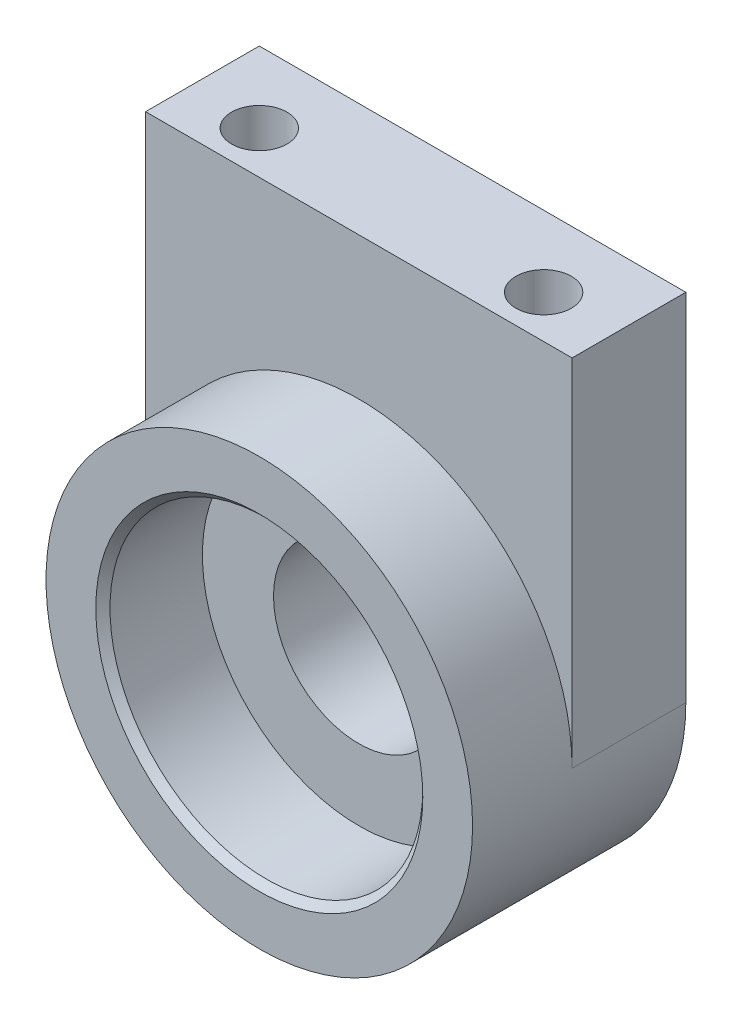
ISO-10303-21;
HEADER;
FILE_DESCRIPTION(('STEP AP214'),'2;1');
FILE_NAME('part.step','',(''),(''),'','','');
FILE_SCHEMA(('AUTOMOTIVE_DESIGN { 1 0 10303 214 1 1 1 1 }'));
ENDSEC;
DATA;
#1=APPLICATION_CONTEXT('core data for automotive mechanical design processes');
#2=APPLICATION_PROTOCOL_DEFINITION('international standard','automotive_design',2000,#1);
#3=PRODUCT_CONTEXT('',#1,'mechanical');
#4=PRODUCT('Part','Part','',(#3));
#5=PRODUCT_RELATED_PRODUCT_CATEGORY('part','',(#4));
#6=PRODUCT_DEFINITION_FORMATION('','',#4);
#7=PRODUCT_DEFINITION_CONTEXT('part definition',#1,'design');
#8=PRODUCT_DEFINITION('design','',#6,#7);
#9=PRODUCT_DEFINITION_SHAPE('','',#8);
#10=(LENGTH_UNIT() NAMED_UNIT(*) SI_UNIT(.MILLI.,.METRE.));
#11=(NAMED_UNIT(*) PLANE_ANGLE_UNIT() SI_UNIT($,.RADIAN.));
#12=(NAMED_UNIT(*) SI_UNIT($,.STERADIAN.) SOLID_ANGLE_UNIT());
#13=UNCERTAINTY_MEASURE_WITH_UNIT(LENGTH_MEASURE(1.E-05),#10,'distance_accuracy_value','');
#14=(GEOMETRIC_REPRESENTATION_CONTEXT(3) GLOBAL_UNCERTAINTY_ASSIGNED_CONTEXT((#13)) GLOBAL_UNIT_ASSIGNED_CONTEXT((#10,
#11,#12)) REPRESENTATION_CONTEXT('',''));
#15=CARTESIAN_POINT('',(0.,0.,0.));
#16=DIRECTION('',(0.,0.,1.));
#17=DIRECTION('',(1.,0.,0.));
#18=AXIS2_PLACEMENT_3D('',#15,#16,#17);
#19=CARTESIAN_POINT('',(0.,0.,7.));
#20=DIRECTION('',(0.,0.,1.));
#21=DIRECTION('',(1.,0.,0.));
#22=AXIS2_PLACEMENT_3D('',#19,#20,#21);
#23=PLANE('',#22);
#24=CARTESIAN_POINT('',(0.,0.,7.));
#25=DIRECTION('',(0.,0.,1.));
#26=DIRECTION('',(1.,0.,0.));
#27=AXIS2_PLACEMENT_3D('',#24,#25,#26);
#28=CIRCLE('',#27,11.5);
#29=CARTESIAN_POINT('',(11.5,0.,7.));
#30=VERTEX_POINT('',#29);
#31=EDGE_CURVE('E11',#30,#30,#28,.F.);
#32=ORIENTED_EDGE('',*,*,#31,.T.);
#33=EDGE_LOOP('',(#32));
#34=FACE_BOUND('',#33,.T.);
#35=CARTESIAN_POINT('',(0.,0.,7.));
#36=DIRECTION('',(0.,0.,1.));
#37=DIRECTION('',(1.,0.,0.));
#38=AXIS2_PLACEMENT_3D('',#35,#36,#37);
#39=CIRCLE('',#38,15.);
#40=CARTESIAN_POINT('',(15.,0.,7.));
#41=VERTEX_POINT('',#40);
#42=EDGE_CURVE('E121',#41,#41,#39,.T.);
#43=ORIENTED_EDGE('',*,*,#42,.T.);
#44=EDGE_LOOP('',(#43));
#45=FACE_BOUND('',#44,.T.);
#46=ADVANCED_FACE('F41',(#34,#45),#23,.T.);
#47=CARTESIAN_POINT('',(0.,0.,7.));
#48=DIRECTION('',(0.,0.,-1.));
#49=DIRECTION('',(-1.,0.,0.));
#50=AXIS2_PLACEMENT_3D('',#47,#48,#49);
#51=CYLINDRICAL_SURFACE('',#50,15.);
#52=ORIENTED_EDGE('',*,*,#42,.F.);
#53=EDGE_LOOP('',(#52));
#54=FACE_BOUND('',#53,.T.);
#55=CARTESIAN_POINT('',(0.,0.,0.));
#56=DIRECTION('',(0.,0.,1.));
#57=DIRECTION('',(1.,0.,0.));
#58=AXIS2_PLACEMENT_3D('',#55,#56,#57);
#59=CIRCLE('',#58,15.);
#60=CARTESIAN_POINT('',(15.,0.,0.));
#61=VERTEX_POINT('',#60);
#62=CARTESIAN_POINT('',(-15.,0.,0.));
#63=VERTEX_POINT('',#62);
#64=EDGE_CURVE('E120',#61,#63,#59,.T.);
#65=ORIENTED_EDGE('',*,*,#64,.T.);
#66=DIRECTION('',(0.,0.,1.));
#67=VECTOR('',#66,1.);
#68=CARTESIAN_POINT('',(-15.,0.,-8.));
#69=LINE('',#68,#67);
#70=CARTESIAN_POINT('',(-15.,0.,-8.));
#71=VERTEX_POINT('',#70);
#72=EDGE_CURVE('E101',#71,#63,#69,.T.);
#73=ORIENTED_EDGE('',*,*,#72,.F.);
#74=CARTESIAN_POINT('',(0.,0.,-8.));
#75=DIRECTION('',(0.,0.,-1.));
#76=DIRECTION('',(-1.,0.,0.));
#77=AXIS2_PLACEMENT_3D('',#74,#75,#76);
#78=CIRCLE('',#77,15.);
#79=CARTESIAN_POINT('',(15.,0.,-8.));
#80=VERTEX_POINT('',#79);
#81=EDGE_CURVE('E95',#80,#71,#78,.T.);
#82=ORIENTED_EDGE('',*,*,#81,.F.);
#83=DIRECTION('',(0.,0.,1.));
#84=VECTOR('',#83,1.);
#85=CARTESIAN_POINT('',(15.,0.,-8.));
#86=LINE('',#85,#84);
#87=EDGE_CURVE('E57',#80,#61,#86,.T.);
#88=ORIENTED_EDGE('',*,*,#87,.T.);
#89=EDGE_LOOP('',(#65,#73,#82,#88));
#90=FACE_BOUND('',#89,.T.);
#91=ADVANCED_FACE('F142',(#54,#90),#51,.T.);
#92=CARTESIAN_POINT('',(0.,0.,7.));
#93=DIRECTION('',(0.,0.,-1.));
#94=DIRECTION('',(-1.,0.,0.));
#95=AXIS2_PLACEMENT_3D('',#92,#93,#94);
#96=CYLINDRICAL_SURFACE('',#95,11.);
#97=CARTESIAN_POINT('',(0.,0.,6.50000000000001));
#98=DIRECTION('',(0.,0.,1.));
#99=DIRECTION('',(1.,0.,0.));
#100=AXIS2_PLACEMENT_3D('',#97,#98,#99);
#101=CIRCLE('',#100,11.);
#102=CARTESIAN_POINT('',(11.,0.,6.50000000000001));
#103=VERTEX_POINT('',#102);
#104=EDGE_CURVE('E50',#103,#103,#101,.T.);
#105=ORIENTED_EDGE('',*,*,#104,.T.);
#106=EDGE_LOOP('',(#105));
#107=FACE_BOUND('',#106,.T.);
#108=CARTESIAN_POINT('',(0.,0.,0.));
#109=DIRECTION('',(0.,0.,1.));
#110=DIRECTION('',(1.,0.,0.));
#111=AXIS2_PLACEMENT_3D('',#108,#109,#110);
#112=CIRCLE('',#111,11.);
#113=CARTESIAN_POINT('',(11.,0.,0.));
#114=VERTEX_POINT('',#113);
#115=EDGE_CURVE('E117',#114,#114,#112,.T.);
#116=ORIENTED_EDGE('',*,*,#115,.F.);
#117=EDGE_LOOP('',(#116));
#118=FACE_BOUND('',#117,.T.);
#119=ADVANCED_FACE('F127',(#107,#118),#96,.F.);
#120=CARTESIAN_POINT('',(0.,0.,0.));
#121=DIRECTION('',(0.,0.,-1.));
#122=DIRECTION('',(-1.,0.,0.));
#123=AXIS2_PLACEMENT_3D('',#120,#121,#122);
#124=PLANE('',#123);
#125=CARTESIAN_POINT('',(0.,0.,0.));
#126=DIRECTION('',(0.,0.,1.));
#127=DIRECTION('',(1.,0.,0.));
#128=AXIS2_PLACEMENT_3D('',#125,#126,#127);
#129=CIRCLE('',#128,6.);
#130=CARTESIAN_POINT('',(6.,0.,0.));
#131=VERTEX_POINT('',#130);
#132=EDGE_CURVE('E203',#131,#131,#129,.T.);
#133=ORIENTED_EDGE('',*,*,#132,.F.);
#134=EDGE_LOOP('',(#133));
#135=FACE_BOUND('',#134,.T.);
#136=ORIENTED_EDGE('',*,*,#115,.T.);
#137=EDGE_LOOP('',(#136));
#138=FACE_BOUND('',#137,.T.);
#139=ADVANCED_FACE('F152',(#135,#138),#124,.F.);
#140=CARTESIAN_POINT('',(-15.,25.,-8.));
#141=DIRECTION('',(1.,0.,0.));
#142=DIRECTION('',(0.,1.,0.));
#143=AXIS2_PLACEMENT_3D('',#140,#141,#142);
#144=PLANE('',#143);
#145=DIRECTION('',(0.,1.,0.));
#146=VECTOR('',#145,1.);
#147=CARTESIAN_POINT('',(-15.,25.,0.));
#148=LINE('',#147,#146);
#149=CARTESIAN_POINT('',(-15.,25.,0.));
#150=VERTEX_POINT('',#149);
#151=EDGE_CURVE('E100',#63,#150,#148,.T.);
#152=ORIENTED_EDGE('',*,*,#151,.T.);
#153=DIRECTION('',(0.,0.,1.));
#154=VECTOR('',#153,1.);
#155=CARTESIAN_POINT('',(-15.,25.,-8.));
#156=LINE('',#155,#154);
#157=CARTESIAN_POINT('',(-15.,25.,-8.));
#158=VERTEX_POINT('',#157);
#159=EDGE_CURVE('E98',#158,#150,#156,.T.);
#160=ORIENTED_EDGE('',*,*,#159,.F.);
#161=DIRECTION('',(0.,1.,0.));
#162=VECTOR('',#161,1.);
#163=CARTESIAN_POINT('',(-15.,25.,-8.));
#164=LINE('',#163,#162);
#165=EDGE_CURVE('E91',#71,#158,#164,.T.);
#166=ORIENTED_EDGE('',*,*,#165,.F.);
#167=ORIENTED_EDGE('',*,*,#72,.T.);
#168=EDGE_LOOP('',(#152,#160,#166,#167));
#169=FACE_BOUND('',#168,.T.);
#170=ADVANCED_FACE('F99',(#169),#144,.F.);
#171=CARTESIAN_POINT('',(15.,25.,-8.));
#172=DIRECTION('',(0.,-1.,0.));
#173=DIRECTION('',(0.,0.,-1.));
#174=AXIS2_PLACEMENT_3D('',#171,#172,#173);
#175=PLANE('',#174);
#176=CARTESIAN_POINT('',(-10.,25.,-3.));
#177=DIRECTION('',(0.,1.,0.));
#178=DIRECTION('',(0.,0.,1.));
#179=AXIS2_PLACEMENT_3D('',#176,#177,#178);
#180=CIRCLE('',#179,1.95);
#181=CARTESIAN_POINT('',(-10.,25.,-1.05));
#182=VERTEX_POINT('',#181);
#183=EDGE_CURVE('E188',#182,#182,#180,.T.);
#184=ORIENTED_EDGE('',*,*,#183,.F.);
#185=EDGE_LOOP('',(#184));
#186=FACE_BOUND('',#185,.T.);
#187=CARTESIAN_POINT('',(10.,25.,-3.));
#188=DIRECTION('',(0.,1.,0.));
#189=DIRECTION('',(0.,0.,1.));
#190=AXIS2_PLACEMENT_3D('',#187,#188,#189);
#191=CIRCLE('',#190,1.95);
#192=CARTESIAN_POINT('',(10.,25.,-1.05));
#193=VERTEX_POINT('',#192);
#194=EDGE_CURVE('E191',#193,#193,#191,.T.);
#195=ORIENTED_EDGE('',*,*,#194,.F.);
#196=EDGE_LOOP('',(#195));
#197=FACE_BOUND('',#196,.T.);
#198=DIRECTION('',(1.,0.,0.));
#199=VECTOR('',#198,1.);
#200=CARTESIAN_POINT('',(15.,25.,0.));
#201=LINE('',#200,#199);
#202=CARTESIAN_POINT('',(15.,25.,0.));
#203=VERTEX_POINT('',#202);
#204=EDGE_CURVE('E83',#150,#203,#201,.T.);
#205=ORIENTED_EDGE('',*,*,#204,.T.);
#206=DIRECTION('',(0.,0.,1.));
#207=VECTOR('',#206,1.);
#208=CARTESIAN_POINT('',(15.,25.,-8.));
#209=LINE('',#208,#207);
#210=CARTESIAN_POINT('',(15.,25.,-8.));
#211=VERTEX_POINT('',#210);
#212=EDGE_CURVE('E102',#211,#203,#209,.T.);
#213=ORIENTED_EDGE('',*,*,#212,.F.);
#214=DIRECTION('',(1.,0.,0.));
#215=VECTOR('',#214,1.);
#216=CARTESIAN_POINT('',(15.,25.,-8.));
#217=LINE('',#216,#215);
#218=EDGE_CURVE('E94',#158,#211,#217,.T.);
#219=ORIENTED_EDGE('',*,*,#218,.F.);
#220=ORIENTED_EDGE('',*,*,#159,.T.);
#221=EDGE_LOOP('',(#205,#213,#219,#220));
#222=FACE_BOUND('',#221,.T.);
#223=ADVANCED_FACE('F104',(#186,#197,#222),#175,.F.);
#224=CARTESIAN_POINT('',(15.,0.,-8.));
#225=DIRECTION('',(-1.,0.,0.));
#226=DIRECTION('',(0.,-1.,0.));
#227=AXIS2_PLACEMENT_3D('',#224,#225,#226);
#228=PLANE('',#227);
#229=DIRECTION('',(0.,-1.,0.));
#230=VECTOR('',#229,1.);
#231=CARTESIAN_POINT('',(15.,0.,0.));
#232=LINE('',#231,#230);
#233=EDGE_CURVE('E112',#203,#61,#232,.T.);
#234=ORIENTED_EDGE('',*,*,#233,.T.);
#235=ORIENTED_EDGE('',*,*,#87,.F.);
#236=DIRECTION('',(0.,-1.,0.));
#237=VECTOR('',#236,1.);
#238=CARTESIAN_POINT('',(15.,0.,-8.));
#239=LINE('',#238,#237);
#240=EDGE_CURVE('E66',#211,#80,#239,.T.);
#241=ORIENTED_EDGE('',*,*,#240,.F.);
#242=ORIENTED_EDGE('',*,*,#212,.T.);
#243=EDGE_LOOP('',(#234,#235,#241,#242));
#244=FACE_BOUND('',#243,.T.);
#245=ADVANCED_FACE('F157',(#244),#228,.F.);
#246=CARTESIAN_POINT('',(0.,0.,-8.));
#247=DIRECTION('',(0.,0.,-1.));
#248=DIRECTION('',(-1.,0.,0.));
#249=AXIS2_PLACEMENT_3D('',#246,#247,#248);
#250=PLANE('',#249);
#251=CARTESIAN_POINT('',(0.,0.,-8.));
#252=DIRECTION('',(0.,0.,-1.));
#253=DIRECTION('',(-1.,0.,0.));
#254=AXIS2_PLACEMENT_3D('',#251,#252,#253);
#255=CIRCLE('',#254,6.);
#256=CARTESIAN_POINT('',(-6.,0.,-8.));
#257=VERTEX_POINT('',#256);
#258=EDGE_CURVE('E194',#257,#257,#255,.F.);
#259=ORIENTED_EDGE('',*,*,#258,.T.);
#260=EDGE_LOOP('',(#259));
#261=FACE_BOUND('',#260,.T.);
#262=ORIENTED_EDGE('',*,*,#81,.T.);
#263=ORIENTED_EDGE('',*,*,#165,.T.);
#264=ORIENTED_EDGE('',*,*,#218,.T.);
#265=ORIENTED_EDGE('',*,*,#240,.T.);
#266=EDGE_LOOP('',(#262,#263,#264,#265));
#267=FACE_BOUND('',#266,.T.);
#268=ADVANCED_FACE('F92',(#261,#267),#250,.T.);
#269=ORIENTED_EDGE('',*,*,#64,.F.);
#270=ORIENTED_EDGE('',*,*,#233,.F.);
#271=ORIENTED_EDGE('',*,*,#204,.F.);
#272=ORIENTED_EDGE('',*,*,#151,.F.);
#273=EDGE_LOOP('',(#269,#270,#271,#272));
#274=FACE_BOUND('',#273,.T.);
#275=ADVANCED_FACE('F162',(#274),#124,.F.);
#276=CARTESIAN_POINT('',(10.,19.,-3.));
#277=DIRECTION('',(0.,1.,0.));
#278=DIRECTION('',(0.,0.,1.));
#279=AXIS2_PLACEMENT_3D('',#276,#277,#278);
#280=CYLINDRICAL_SURFACE('',#279,1.95);
#281=CARTESIAN_POINT('',(10.,19.,-3.));
#282=DIRECTION('',(0.,1.,0.));
#283=DIRECTION('',(0.,0.,1.));
#284=AXIS2_PLACEMENT_3D('',#281,#282,#283);
#285=CIRCLE('',#284,1.95);
#286=CARTESIAN_POINT('',(10.,19.,-1.05));
#287=VERTEX_POINT('',#286);
#288=EDGE_CURVE('E199',#287,#287,#285,.T.);
#289=ORIENTED_EDGE('',*,*,#288,.F.);
#290=EDGE_LOOP('',(#289));
#291=FACE_BOUND('',#290,.T.);
#292=ORIENTED_EDGE('',*,*,#194,.T.);
#293=EDGE_LOOP('',(#292));
#294=FACE_BOUND('',#293,.T.);
#295=ADVANCED_FACE('F165',(#291,#294),#280,.F.);
#296=CARTESIAN_POINT('',(10.,19.,-3.));
#297=DIRECTION('',(0.,1.,0.));
#298=DIRECTION('',(0.,0.,1.));
#299=AXIS2_PLACEMENT_3D('',#296,#297,#298);
#300=PLANE('',#299);
#301=ORIENTED_EDGE('',*,*,#288,.T.);
#302=EDGE_LOOP('',(#301));
#303=FACE_BOUND('',#302,.T.);
#304=ADVANCED_FACE('F170',(#303),#300,.T.);
#305=CARTESIAN_POINT('',(-10.,19.,-3.));
#306=DIRECTION('',(0.,1.,0.));
#307=DIRECTION('',(0.,0.,1.));
#308=AXIS2_PLACEMENT_3D('',#305,#306,#307);
#309=CYLINDRICAL_SURFACE('',#308,1.95);
#310=CARTESIAN_POINT('',(-10.,19.,-3.));
#311=DIRECTION('',(0.,1.,0.));
#312=DIRECTION('',(0.,0.,1.));
#313=AXIS2_PLACEMENT_3D('',#310,#311,#312);
#314=CIRCLE('',#313,1.95);
#315=CARTESIAN_POINT('',(-10.,19.,-1.05));
#316=VERTEX_POINT('',#315);
#317=EDGE_CURVE('E110',#316,#316,#314,.T.);
#318=ORIENTED_EDGE('',*,*,#317,.F.);
#319=EDGE_LOOP('',(#318));
#320=FACE_BOUND('',#319,.T.);
#321=ORIENTED_EDGE('',*,*,#183,.T.);
#322=EDGE_LOOP('',(#321));
#323=FACE_BOUND('',#322,.T.);
#324=ADVANCED_FACE('F173',(#320,#323),#309,.F.);
#325=CARTESIAN_POINT('',(-10.,19.,-3.));
#326=DIRECTION('',(0.,1.,0.));
#327=DIRECTION('',(0.,0.,1.));
#328=AXIS2_PLACEMENT_3D('',#325,#326,#327);
#329=PLANE('',#328);
#330=ORIENTED_EDGE('',*,*,#317,.T.);
#331=EDGE_LOOP('',(#330));
#332=FACE_BOUND('',#331,.T.);
#333=ADVANCED_FACE('F137',(#332),#329,.T.);
#334=CARTESIAN_POINT('',(0.,0.,-24.9705627484771));
#335=DIRECTION('',(0.,0.,1.));
#336=DIRECTION('',(1.,0.,0.));
#337=AXIS2_PLACEMENT_3D('',#334,#335,#336);
#338=CYLINDRICAL_SURFACE('',#337,6.);
#339=ORIENTED_EDGE('',*,*,#132,.T.);
#340=EDGE_LOOP('',(#339));
#341=FACE_BOUND('',#340,.T.);
#342=ORIENTED_EDGE('',*,*,#258,.F.);
#343=EDGE_LOOP('',(#342));
#344=FACE_BOUND('',#343,.T.);
#345=ADVANCED_FACE('F131',(#341,#344),#338,.F.);
#346=CARTESIAN_POINT('',(0.,0.,6.50000000000001));
#347=DIRECTION('',(0.,0.,1.));
#348=DIRECTION('',(1.,0.,0.));
#349=AXIS2_PLACEMENT_3D('',#346,#347,#348);
#350=CONICAL_SURFACE('',#349,11.,0.785398163397445);
#351=ORIENTED_EDGE('',*,*,#31,.F.);
#352=EDGE_LOOP('',(#351));
#353=FACE_BOUND('',#352,.T.);
#354=ORIENTED_EDGE('',*,*,#104,.F.);
#355=EDGE_LOOP('',(#354));
#356=FACE_BOUND('',#355,.T.);
#357=ADVANCED_FACE('F44',(#353,#356),#350,.F.);
#358=CLOSED_SHELL('',(#46,#91,#119,#139,#170,#223,#245,#268,#275,#295,#304,#324,#333,#345,#357));
#359=MANIFOLD_SOLID_BREP('B2',#358);
#360=ADVANCED_BREP_SHAPE_REPRESENTATION('',(#18,#359),#14);
#361=SHAPE_DEFINITION_REPRESENTATION(#9,#360);
ENDSEC;
END-ISO-10303-21;
